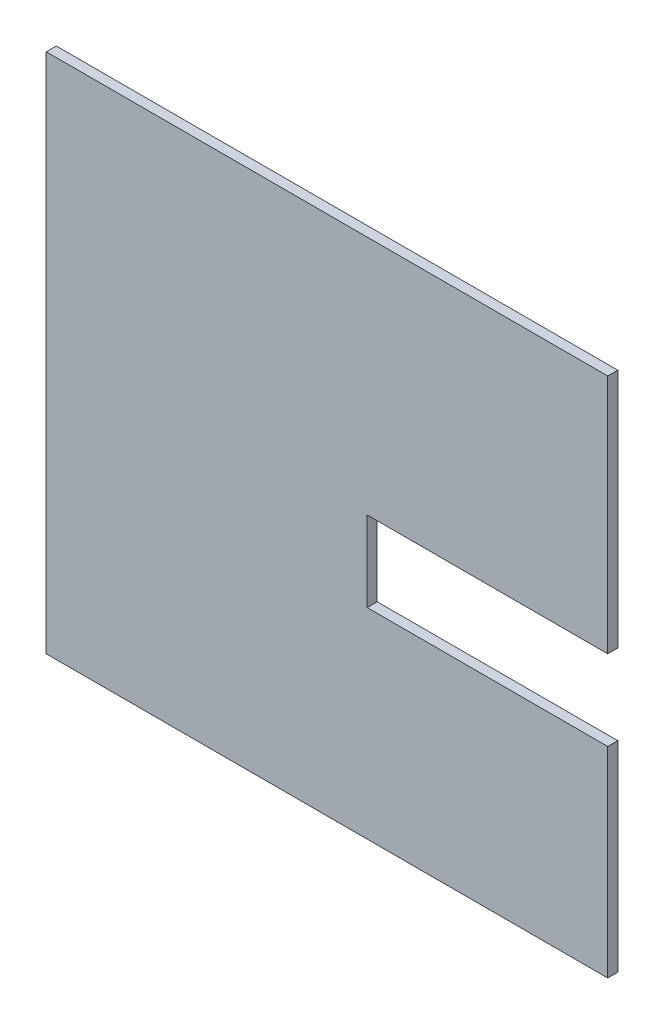
ISO-10303-21;
HEADER;
FILE_DESCRIPTION(('STEP AP214'),'2;1');
FILE_NAME('part.step','',(''),(''),'','','');
FILE_SCHEMA(('AUTOMOTIVE_DESIGN { 1 0 10303 214 1 1 1 1 }'));
ENDSEC;
DATA;
#1=APPLICATION_CONTEXT('core data for automotive mechanical design processes');
#2=APPLICATION_PROTOCOL_DEFINITION('international standard','automotive_design',2000,#1);
#3=PRODUCT_CONTEXT('',#1,'mechanical');
#4=PRODUCT('Part','Part','',(#3));
#5=PRODUCT_RELATED_PRODUCT_CATEGORY('part','',(#4));
#6=PRODUCT_DEFINITION_FORMATION('','',#4);
#7=PRODUCT_DEFINITION_CONTEXT('part definition',#1,'design');
#8=PRODUCT_DEFINITION('design','',#6,#7);
#9=PRODUCT_DEFINITION_SHAPE('','',#8);
#10=(LENGTH_UNIT() NAMED_UNIT(*) SI_UNIT(.MILLI.,.METRE.));
#11=(NAMED_UNIT(*) PLANE_ANGLE_UNIT() SI_UNIT($,.RADIAN.));
#12=(NAMED_UNIT(*) SI_UNIT($,.STERADIAN.) SOLID_ANGLE_UNIT());
#13=UNCERTAINTY_MEASURE_WITH_UNIT(LENGTH_MEASURE(1.E-05),#10,'distance_accuracy_value','');
#14=(GEOMETRIC_REPRESENTATION_CONTEXT(3) GLOBAL_UNCERTAINTY_ASSIGNED_CONTEXT((#13)) GLOBAL_UNIT_ASSIGNED_CONTEXT((#10,
#11,#12)) REPRESENTATION_CONTEXT('',''));
#15=CARTESIAN_POINT('',(0.,0.,0.));
#16=DIRECTION('',(0.,0.,1.));
#17=DIRECTION('',(1.,0.,0.));
#18=AXIS2_PLACEMENT_3D('',#15,#16,#17);
#19=CARTESIAN_POINT('',(177.8,-165.1,3.175));
#20=DIRECTION('',(-1.,0.,0.));
#21=DIRECTION('',(0.,0.,1.));
#22=AXIS2_PLACEMENT_3D('',#19,#20,#21);
#23=PLANE('',#22);
#24=DIRECTION('',(0.,1.,0.));
#25=VECTOR('',#24,1.);
#26=CARTESIAN_POINT('',(177.8,-165.1,-3.175));
#27=LINE('',#26,#25);
#28=CARTESIAN_POINT('',(177.8,-165.1,-3.175));
#29=VERTEX_POINT('',#28);
#30=CARTESIAN_POINT('',(177.8,-38.1,-3.175));
#31=VERTEX_POINT('',#30);
#32=EDGE_CURVE('E129',#29,#31,#27,.T.);
#33=ORIENTED_EDGE('',*,*,#32,.T.);
#34=DIRECTION('',(0.,0.,1.));
#35=VECTOR('',#34,1.);
#36=CARTESIAN_POINT('',(177.8,-38.1,-3.175));
#37=LINE('',#36,#35);
#38=CARTESIAN_POINT('',(177.8,-38.1,3.175));
#39=VERTEX_POINT('',#38);
#40=EDGE_CURVE('E130',#31,#39,#37,.T.);
#41=ORIENTED_EDGE('',*,*,#40,.T.);
#42=DIRECTION('',(0.,1.,0.));
#43=VECTOR('',#42,1.);
#44=CARTESIAN_POINT('',(177.8,-165.1,3.175));
#45=LINE('',#44,#43);
#46=CARTESIAN_POINT('',(177.8,-165.1,3.175));
#47=VERTEX_POINT('',#46);
#48=EDGE_CURVE('E158',#47,#39,#45,.T.);
#49=ORIENTED_EDGE('',*,*,#48,.F.);
#50=DIRECTION('',(0.,0.,-1.));
#51=VECTOR('',#50,1.);
#52=CARTESIAN_POINT('',(177.8,-165.1,3.175));
#53=LINE('',#52,#51);
#54=EDGE_CURVE('E143',#47,#29,#53,.T.);
#55=ORIENTED_EDGE('',*,*,#54,.T.);
#56=EDGE_LOOP('',(#33,#41,#49,#55));
#57=FACE_BOUND('',#56,.T.);
#58=ADVANCED_FACE('F35',(#57),#23,.F.);
#59=CARTESIAN_POINT('',(177.8,12.7,3.175));
#60=VERTEX_POINT('',#59);
#61=CARTESIAN_POINT('',(177.8,165.1,3.175));
#62=VERTEX_POINT('',#61);
#63=EDGE_CURVE('E87',#60,#62,#45,.T.);
#64=ORIENTED_EDGE('',*,*,#63,.F.);
#65=DIRECTION('',(0.,0.,1.));
#66=VECTOR('',#65,1.);
#67=CARTESIAN_POINT('',(177.8,12.7,-3.175));
#68=LINE('',#67,#66);
#69=CARTESIAN_POINT('',(177.8,12.7,-3.175));
#70=VERTEX_POINT('',#69);
#71=EDGE_CURVE('E113',#70,#60,#68,.T.);
#72=ORIENTED_EDGE('',*,*,#71,.F.);
#73=CARTESIAN_POINT('',(177.8,165.1,-3.175));
#74=VERTEX_POINT('',#73);
#75=EDGE_CURVE('E121',#70,#74,#27,.T.);
#76=ORIENTED_EDGE('',*,*,#75,.T.);
#77=DIRECTION('',(0.,0.,-1.));
#78=VECTOR('',#77,1.);
#79=CARTESIAN_POINT('',(177.8,165.1,3.175));
#80=LINE('',#79,#78);
#81=EDGE_CURVE('E11',#62,#74,#80,.T.);
#82=ORIENTED_EDGE('',*,*,#81,.F.);
#83=EDGE_LOOP('',(#64,#72,#76,#82));
#84=FACE_BOUND('',#83,.T.);
#85=ADVANCED_FACE('F37',(#84),#23,.F.);
#86=CARTESIAN_POINT('',(-177.8,165.1,3.175));
#87=DIRECTION('',(0.,-1.,0.));
#88=DIRECTION('',(0.,0.,-1.));
#89=AXIS2_PLACEMENT_3D('',#86,#87,#88);
#90=PLANE('',#89);
#91=DIRECTION('',(-1.,0.,0.));
#92=VECTOR('',#91,1.);
#93=CARTESIAN_POINT('',(-177.8,165.1,-3.175));
#94=LINE('',#93,#92);
#95=CARTESIAN_POINT('',(-177.8,165.1,-3.175));
#96=VERTEX_POINT('',#95);
#97=EDGE_CURVE('E128',#74,#96,#94,.T.);
#98=ORIENTED_EDGE('',*,*,#97,.T.);
#99=DIRECTION('',(0.,0.,-1.));
#100=VECTOR('',#99,1.);
#101=CARTESIAN_POINT('',(-177.8,165.1,3.175));
#102=LINE('',#101,#100);
#103=CARTESIAN_POINT('',(-177.8,165.1,3.175));
#104=VERTEX_POINT('',#103);
#105=EDGE_CURVE('E43',#104,#96,#102,.T.);
#106=ORIENTED_EDGE('',*,*,#105,.F.);
#107=DIRECTION('',(-1.,0.,0.));
#108=VECTOR('',#107,1.);
#109=CARTESIAN_POINT('',(-177.8,165.1,3.175));
#110=LINE('',#109,#108);
#111=EDGE_CURVE('E160',#62,#104,#110,.T.);
#112=ORIENTED_EDGE('',*,*,#111,.F.);
#113=ORIENTED_EDGE('',*,*,#81,.T.);
#114=EDGE_LOOP('',(#98,#106,#112,#113));
#115=FACE_BOUND('',#114,.T.);
#116=ADVANCED_FACE('F191',(#115),#90,.F.);
#117=CARTESIAN_POINT('',(-177.8,-165.1,3.175));
#118=DIRECTION('',(1.,0.,0.));
#119=DIRECTION('',(0.,0.,-1.));
#120=AXIS2_PLACEMENT_3D('',#117,#118,#119);
#121=PLANE('',#120);
#122=DIRECTION('',(0.,-1.,0.));
#123=VECTOR('',#122,1.);
#124=CARTESIAN_POINT('',(-177.8,-165.1,-3.175));
#125=LINE('',#124,#123);
#126=CARTESIAN_POINT('',(-177.8,-165.1,-3.175));
#127=VERTEX_POINT('',#126);
#128=EDGE_CURVE('E140',#96,#127,#125,.T.);
#129=ORIENTED_EDGE('',*,*,#128,.T.);
#130=DIRECTION('',(0.,0.,-1.));
#131=VECTOR('',#130,1.);
#132=CARTESIAN_POINT('',(-177.8,-165.1,3.175));
#133=LINE('',#132,#131);
#134=CARTESIAN_POINT('',(-177.8,-165.1,3.175));
#135=VERTEX_POINT('',#134);
#136=EDGE_CURVE('E145',#135,#127,#133,.T.);
#137=ORIENTED_EDGE('',*,*,#136,.F.);
#138=DIRECTION('',(0.,-1.,0.));
#139=VECTOR('',#138,1.);
#140=CARTESIAN_POINT('',(-177.8,-165.1,3.175));
#141=LINE('',#140,#139);
#142=EDGE_CURVE('E152',#104,#135,#141,.T.);
#143=ORIENTED_EDGE('',*,*,#142,.F.);
#144=ORIENTED_EDGE('',*,*,#105,.T.);
#145=EDGE_LOOP('',(#129,#137,#143,#144));
#146=FACE_BOUND('',#145,.T.);
#147=ADVANCED_FACE('F150',(#146),#121,.F.);
#148=CARTESIAN_POINT('',(-177.8,-165.1,3.175));
#149=DIRECTION('',(0.,1.,0.));
#150=DIRECTION('',(0.,0.,1.));
#151=AXIS2_PLACEMENT_3D('',#148,#149,#150);
#152=PLANE('',#151);
#153=DIRECTION('',(1.,0.,0.));
#154=VECTOR('',#153,1.);
#155=CARTESIAN_POINT('',(-177.8,-165.1,-3.175));
#156=LINE('',#155,#154);
#157=EDGE_CURVE('E80',#127,#29,#156,.T.);
#158=ORIENTED_EDGE('',*,*,#157,.T.);
#159=ORIENTED_EDGE('',*,*,#54,.F.);
#160=DIRECTION('',(1.,0.,0.));
#161=VECTOR('',#160,1.);
#162=CARTESIAN_POINT('',(-177.8,-165.1,3.175));
#163=LINE('',#162,#161);
#164=EDGE_CURVE('E59',#135,#47,#163,.T.);
#165=ORIENTED_EDGE('',*,*,#164,.F.);
#166=ORIENTED_EDGE('',*,*,#136,.T.);
#167=EDGE_LOOP('',(#158,#159,#165,#166));
#168=FACE_BOUND('',#167,.T.);
#169=ADVANCED_FACE('F159',(#168),#152,.F.);
#170=CARTESIAN_POINT('',(0.,0.,3.175));
#171=DIRECTION('',(0.,0.,-1.));
#172=DIRECTION('',(-1.,0.,0.));
#173=AXIS2_PLACEMENT_3D('',#170,#171,#172);
#174=PLANE('',#173);
#175=ORIENTED_EDGE('',*,*,#48,.T.);
#176=DIRECTION('',(1.,0.,0.));
#177=VECTOR('',#176,1.);
#178=CARTESIAN_POINT('',(177.8,-38.1,3.175));
#179=LINE('',#178,#177);
#180=CARTESIAN_POINT('',(25.3999999999999,-38.1,3.175));
#181=VERTEX_POINT('',#180);
#182=EDGE_CURVE('E117',#181,#39,#179,.T.);
#183=ORIENTED_EDGE('',*,*,#182,.F.);
#184=DIRECTION('',(0.,-1.,0.));
#185=VECTOR('',#184,1.);
#186=CARTESIAN_POINT('',(25.3999999999999,-38.1,3.175));
#187=LINE('',#186,#185);
#188=CARTESIAN_POINT('',(25.3999999999999,12.7,3.175));
#189=VERTEX_POINT('',#188);
#190=EDGE_CURVE('E167',#189,#181,#187,.T.);
#191=ORIENTED_EDGE('',*,*,#190,.F.);
#192=DIRECTION('',(-1.,0.,0.));
#193=VECTOR('',#192,1.);
#194=CARTESIAN_POINT('',(177.8,12.7,3.175));
#195=LINE('',#194,#193);
#196=EDGE_CURVE('E170',#60,#189,#195,.T.);
#197=ORIENTED_EDGE('',*,*,#196,.F.);
#198=ORIENTED_EDGE('',*,*,#63,.T.);
#199=ORIENTED_EDGE('',*,*,#111,.T.);
#200=ORIENTED_EDGE('',*,*,#142,.T.);
#201=ORIENTED_EDGE('',*,*,#164,.T.);
#202=EDGE_LOOP('',(#175,#183,#191,#197,#198,#199,#200,#201));
#203=FACE_BOUND('',#202,.T.);
#204=ADVANCED_FACE('F175',(#203),#174,.F.);
#205=CARTESIAN_POINT('',(0.,0.,-3.175));
#206=DIRECTION('',(0.,0.,-1.));
#207=DIRECTION('',(-1.,0.,0.));
#208=AXIS2_PLACEMENT_3D('',#205,#206,#207);
#209=PLANE('',#208);
#210=DIRECTION('',(1.,0.,0.));
#211=VECTOR('',#210,1.);
#212=CARTESIAN_POINT('',(177.8,-38.1,-3.175));
#213=LINE('',#212,#211);
#214=CARTESIAN_POINT('',(25.3999999999999,-38.1,-3.175));
#215=VERTEX_POINT('',#214);
#216=EDGE_CURVE('E123',#215,#31,#213,.T.);
#217=ORIENTED_EDGE('',*,*,#216,.T.);
#218=ORIENTED_EDGE('',*,*,#32,.F.);
#219=ORIENTED_EDGE('',*,*,#157,.F.);
#220=ORIENTED_EDGE('',*,*,#128,.F.);
#221=ORIENTED_EDGE('',*,*,#97,.F.);
#222=ORIENTED_EDGE('',*,*,#75,.F.);
#223=DIRECTION('',(-1.,0.,0.));
#224=VECTOR('',#223,1.);
#225=CARTESIAN_POINT('',(177.8,12.7,-3.175));
#226=LINE('',#225,#224);
#227=CARTESIAN_POINT('',(25.3999999999999,12.7,-3.175));
#228=VERTEX_POINT('',#227);
#229=EDGE_CURVE('E109',#70,#228,#226,.T.);
#230=ORIENTED_EDGE('',*,*,#229,.T.);
#231=DIRECTION('',(0.,-1.,0.));
#232=VECTOR('',#231,1.);
#233=CARTESIAN_POINT('',(25.3999999999999,-38.1,-3.175));
#234=LINE('',#233,#232);
#235=EDGE_CURVE('E50',#228,#215,#234,.T.);
#236=ORIENTED_EDGE('',*,*,#235,.T.);
#237=EDGE_LOOP('',(#217,#218,#219,#220,#221,#222,#230,#236));
#238=FACE_BOUND('',#237,.T.);
#239=ADVANCED_FACE('F126',(#238),#209,.T.);
#240=CARTESIAN_POINT('',(177.8,-38.1,-3.175));
#241=DIRECTION('',(0.,-1.,0.));
#242=DIRECTION('',(1.,0.,0.));
#243=AXIS2_PLACEMENT_3D('',#240,#241,#242);
#244=PLANE('',#243);
#245=ORIENTED_EDGE('',*,*,#182,.T.);
#246=ORIENTED_EDGE('',*,*,#40,.F.);
#247=ORIENTED_EDGE('',*,*,#216,.F.);
#248=DIRECTION('',(0.,0.,1.));
#249=VECTOR('',#248,1.);
#250=CARTESIAN_POINT('',(25.3999999999999,-38.1,-3.175));
#251=LINE('',#250,#249);
#252=EDGE_CURVE('E134',#215,#181,#251,.T.);
#253=ORIENTED_EDGE('',*,*,#252,.T.);
#254=EDGE_LOOP('',(#245,#246,#247,#253));
#255=FACE_BOUND('',#254,.T.);
#256=ADVANCED_FACE('F178',(#255),#244,.F.);
#257=CARTESIAN_POINT('',(25.3999999999999,-38.1,-3.175));
#258=DIRECTION('',(-1.,0.,0.));
#259=DIRECTION('',(0.,0.,1.));
#260=AXIS2_PLACEMENT_3D('',#257,#258,#259);
#261=PLANE('',#260);
#262=ORIENTED_EDGE('',*,*,#190,.T.);
#263=ORIENTED_EDGE('',*,*,#252,.F.);
#264=ORIENTED_EDGE('',*,*,#235,.F.);
#265=DIRECTION('',(0.,0.,1.));
#266=VECTOR('',#265,1.);
#267=CARTESIAN_POINT('',(25.3999999999999,12.7,-3.175));
#268=LINE('',#267,#266);
#269=EDGE_CURVE('E114',#228,#189,#268,.T.);
#270=ORIENTED_EDGE('',*,*,#269,.T.);
#271=EDGE_LOOP('',(#262,#263,#264,#270));
#272=FACE_BOUND('',#271,.T.);
#273=ADVANCED_FACE('F176',(#272),#261,.F.);
#274=CARTESIAN_POINT('',(177.8,12.7,-3.175));
#275=DIRECTION('',(0.,1.,0.));
#276=DIRECTION('',(-1.,0.,0.));
#277=AXIS2_PLACEMENT_3D('',#274,#275,#276);
#278=PLANE('',#277);
#279=ORIENTED_EDGE('',*,*,#196,.T.);
#280=ORIENTED_EDGE('',*,*,#269,.F.);
#281=ORIENTED_EDGE('',*,*,#229,.F.);
#282=ORIENTED_EDGE('',*,*,#71,.T.);
#283=EDGE_LOOP('',(#279,#280,#281,#282));
#284=FACE_BOUND('',#283,.T.);
#285=ADVANCED_FACE('F112',(#284),#278,.F.);
#286=CLOSED_SHELL('',(#58,#85,#116,#147,#169,#204,#239,#256,#273,#285));
#287=MANIFOLD_SOLID_BREP('B2',#286);
#288=ADVANCED_BREP_SHAPE_REPRESENTATION('',(#18,#287),#14);
#289=SHAPE_DEFINITION_REPRESENTATION(#9,#288);
ENDSEC;
END-ISO-10303-21;
